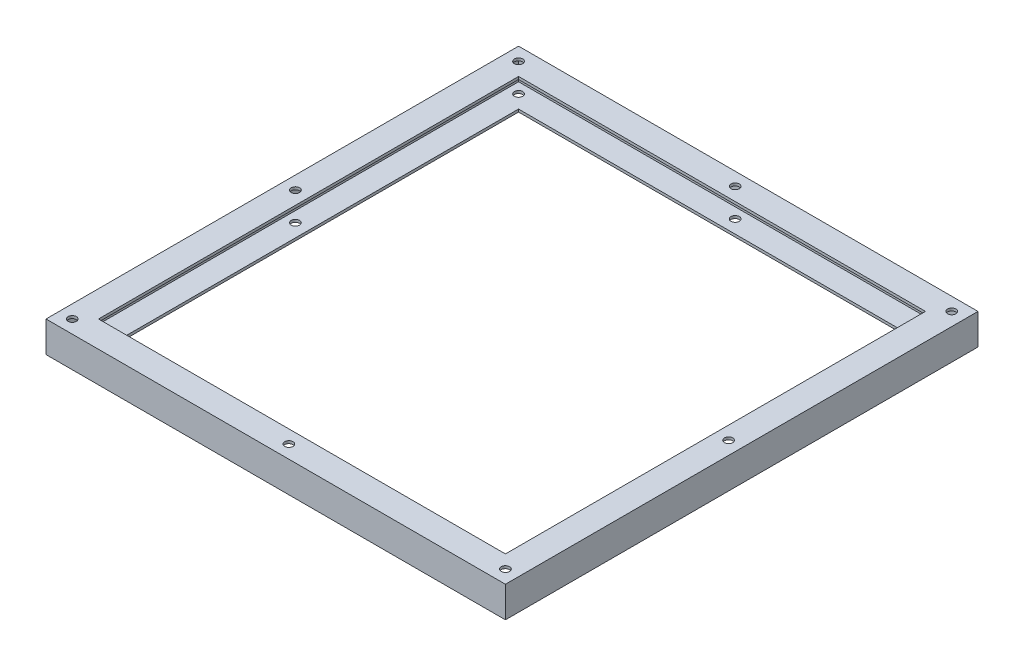
ISO-10303-21;
HEADER;
FILE_DESCRIPTION(('STEP AP214'),'2;1');
FILE_NAME('part.step','',(''),(''),'','','');
FILE_SCHEMA(('AUTOMOTIVE_DESIGN { 1 0 10303 214 1 1 1 1 }'));
ENDSEC;
DATA;
#1=APPLICATION_CONTEXT('core data for automotive mechanical design processes');
#2=APPLICATION_PROTOCOL_DEFINITION('international standard','automotive_design',2000,#1);
#3=PRODUCT_CONTEXT('',#1,'mechanical');
#4=PRODUCT('Part','Part','',(#3));
#5=PRODUCT_RELATED_PRODUCT_CATEGORY('part','',(#4));
#6=PRODUCT_DEFINITION_FORMATION('','',#4);
#7=PRODUCT_DEFINITION_CONTEXT('part definition',#1,'design');
#8=PRODUCT_DEFINITION('design','',#6,#7);
#9=PRODUCT_DEFINITION_SHAPE('','',#8);
#10=(LENGTH_UNIT() NAMED_UNIT(*) SI_UNIT(.MILLI.,.METRE.));
#11=(NAMED_UNIT(*) PLANE_ANGLE_UNIT() SI_UNIT($,.RADIAN.));
#12=(NAMED_UNIT(*) SI_UNIT($,.STERADIAN.) SOLID_ANGLE_UNIT());
#13=UNCERTAINTY_MEASURE_WITH_UNIT(LENGTH_MEASURE(1.E-05),#10,'distance_accuracy_value','');
#14=(GEOMETRIC_REPRESENTATION_CONTEXT(3) GLOBAL_UNCERTAINTY_ASSIGNED_CONTEXT((#13)) GLOBAL_UNIT_ASSIGNED_CONTEXT((#10,
#11,#12)) REPRESENTATION_CONTEXT('',''));
#15=CARTESIAN_POINT('',(0.,0.,0.));
#16=DIRECTION('',(0.,0.,1.));
#17=DIRECTION('',(1.,0.,0.));
#18=AXIS2_PLACEMENT_3D('',#15,#16,#17);
#19=CARTESIAN_POINT('',(0.,23.5,-20.));
#20=DIRECTION('',(0.,0.,1.));
#21=DIRECTION('',(1.,0.,0.));
#22=AXIS2_PLACEMENT_3D('',#19,#20,#21);
#23=PLANE('',#22);
#24=DIRECTION('',(1.,0.,0.));
#25=VECTOR('',#24,1.);
#26=CARTESIAN_POINT('',(0.,21.5,-20.));
#27=LINE('',#26,#25);
#28=CARTESIAN_POINT('',(20.,21.5,-20.));
#29=VERTEX_POINT('',#28);
#30=CARTESIAN_POINT('',(330.,21.5,-20.));
#31=VERTEX_POINT('',#30);
#32=EDGE_CURVE('E60',#29,#31,#27,.T.);
#33=ORIENTED_EDGE('',*,*,#32,.F.);
#34=DIRECTION('',(0.,-1.,0.));
#35=VECTOR('',#34,1.);
#36=CARTESIAN_POINT('',(20.,23.5,-20.));
#37=LINE('',#36,#35);
#38=CARTESIAN_POINT('',(20.,23.5,-20.));
#39=VERTEX_POINT('',#38);
#40=EDGE_CURVE('E344',#39,#29,#37,.T.);
#41=ORIENTED_EDGE('',*,*,#40,.F.);
#42=DIRECTION('',(-1.,0.,0.));
#43=VECTOR('',#42,1.);
#44=CARTESIAN_POINT('',(0.,23.5,-20.));
#45=LINE('',#44,#43);
#46=CARTESIAN_POINT('',(330.,23.5,-20.));
#47=VERTEX_POINT('',#46);
#48=EDGE_CURVE('E278',#47,#39,#45,.T.);
#49=ORIENTED_EDGE('',*,*,#48,.F.);
#50=DIRECTION('',(0.,-1.,0.));
#51=VECTOR('',#50,1.);
#52=CARTESIAN_POINT('',(330.,23.5,-20.));
#53=LINE('',#52,#51);
#54=EDGE_CURVE('E349',#47,#31,#53,.T.);
#55=ORIENTED_EDGE('',*,*,#54,.T.);
#56=EDGE_LOOP('',(#33,#41,#49,#55));
#57=FACE_BOUND('',#56,.T.);
#58=ADVANCED_FACE('F35',(#57),#23,.F.);
#59=CARTESIAN_POINT('',(20.,23.5,0.));
#60=DIRECTION('',(-1.,0.,0.));
#61=DIRECTION('',(0.,0.,1.));
#62=AXIS2_PLACEMENT_3D('',#59,#60,#61);
#63=PLANE('',#62);
#64=DIRECTION('',(0.,0.,1.));
#65=VECTOR('',#64,1.);
#66=CARTESIAN_POINT('',(20.,21.5,0.));
#67=LINE('',#66,#65);
#68=CARTESIAN_POINT('',(20.,21.5,-340.000000000001));
#69=VERTEX_POINT('',#68);
#70=EDGE_CURVE('E249',#69,#29,#67,.T.);
#71=ORIENTED_EDGE('',*,*,#70,.F.);
#72=DIRECTION('',(0.,-1.,0.));
#73=VECTOR('',#72,1.);
#74=CARTESIAN_POINT('',(20.,23.5,-340.000000000001));
#75=LINE('',#74,#73);
#76=CARTESIAN_POINT('',(20.,23.5,-340.000000000001));
#77=VERTEX_POINT('',#76);
#78=EDGE_CURVE('E357',#77,#69,#75,.T.);
#79=ORIENTED_EDGE('',*,*,#78,.F.);
#80=DIRECTION('',(0.,0.,-1.));
#81=VECTOR('',#80,1.);
#82=CARTESIAN_POINT('',(20.,23.5,0.));
#83=LINE('',#82,#81);
#84=EDGE_CURVE('E281',#39,#77,#83,.T.);
#85=ORIENTED_EDGE('',*,*,#84,.F.);
#86=ORIENTED_EDGE('',*,*,#40,.T.);
#87=EDGE_LOOP('',(#71,#79,#85,#86));
#88=FACE_BOUND('',#87,.T.);
#89=ADVANCED_FACE('F427',(#88),#63,.F.);
#90=CARTESIAN_POINT('',(0.,23.5,-340.000000000001));
#91=DIRECTION('',(0.,0.,-1.));
#92=DIRECTION('',(-1.,0.,0.));
#93=AXIS2_PLACEMENT_3D('',#90,#91,#92);
#94=PLANE('',#93);
#95=DIRECTION('',(-1.,0.,0.));
#96=VECTOR('',#95,1.);
#97=CARTESIAN_POINT('',(0.,21.5,-340.000000000001));
#98=LINE('',#97,#96);
#99=CARTESIAN_POINT('',(330.,21.5,-340.000000000001));
#100=VERTEX_POINT('',#99);
#101=EDGE_CURVE('E247',#100,#69,#98,.T.);
#102=ORIENTED_EDGE('',*,*,#101,.F.);
#103=DIRECTION('',(0.,-1.,0.));
#104=VECTOR('',#103,1.);
#105=CARTESIAN_POINT('',(330.,23.5,-340.000000000001));
#106=LINE('',#105,#104);
#107=CARTESIAN_POINT('',(330.,23.5,-340.000000000001));
#108=VERTEX_POINT('',#107);
#109=EDGE_CURVE('E353',#108,#100,#106,.T.);
#110=ORIENTED_EDGE('',*,*,#109,.F.);
#111=DIRECTION('',(1.,0.,0.));
#112=VECTOR('',#111,1.);
#113=CARTESIAN_POINT('',(0.,23.5,-340.000000000001));
#114=LINE('',#113,#112);
#115=EDGE_CURVE('E283',#77,#108,#114,.T.);
#116=ORIENTED_EDGE('',*,*,#115,.F.);
#117=ORIENTED_EDGE('',*,*,#78,.T.);
#118=EDGE_LOOP('',(#102,#110,#116,#117));
#119=FACE_BOUND('',#118,.T.);
#120=ADVANCED_FACE('F434',(#119),#94,.F.);
#121=CARTESIAN_POINT('',(330.,23.5,0.));
#122=DIRECTION('',(1.,0.,0.));
#123=DIRECTION('',(0.,0.,-1.));
#124=AXIS2_PLACEMENT_3D('',#121,#122,#123);
#125=PLANE('',#124);
#126=DIRECTION('',(0.,0.,-1.));
#127=VECTOR('',#126,1.);
#128=CARTESIAN_POINT('',(330.,21.5,0.));
#129=LINE('',#128,#127);
#130=EDGE_CURVE('E245',#31,#100,#129,.T.);
#131=ORIENTED_EDGE('',*,*,#130,.F.);
#132=ORIENTED_EDGE('',*,*,#54,.F.);
#133=DIRECTION('',(0.,0.,1.));
#134=VECTOR('',#133,1.);
#135=CARTESIAN_POINT('',(330.,23.5,0.));
#136=LINE('',#135,#134);
#137=EDGE_CURVE('E285',#108,#47,#136,.T.);
#138=ORIENTED_EDGE('',*,*,#137,.F.);
#139=ORIENTED_EDGE('',*,*,#109,.T.);
#140=EDGE_LOOP('',(#131,#132,#138,#139));
#141=FACE_BOUND('',#140,.T.);
#142=ADVANCED_FACE('F590',(#141),#125,.F.);
#143=CARTESIAN_POINT('',(9.99999999999871,23.5,-9.99999999999871));
#144=DIRECTION('',(0.,-1.,0.));
#145=DIRECTION('',(0.,0.,-1.));
#146=AXIS2_PLACEMENT_3D('',#143,#144,#145);
#147=CYLINDRICAL_SURFACE('',#146,3.175);
#148=CARTESIAN_POINT('',(9.99999999999871,23.5,-9.99999999999871));
#149=DIRECTION('',(0.,1.,0.));
#150=DIRECTION('',(0.,0.,1.));
#151=AXIS2_PLACEMENT_3D('',#148,#149,#150);
#152=CIRCLE('',#151,3.175);
#153=CARTESIAN_POINT('',(9.99999999999871,23.5,-6.82499999999871));
#154=VERTEX_POINT('',#153);
#155=EDGE_CURVE('E275',#154,#154,#152,.T.);
#156=ORIENTED_EDGE('',*,*,#155,.T.);
#157=EDGE_LOOP('',(#156));
#158=FACE_BOUND('',#157,.T.);
#159=CARTESIAN_POINT('',(9.99999999999871,21.5,-9.99999999999871));
#160=DIRECTION('',(0.,-1.,0.));
#161=DIRECTION('',(0.,0.,-1.));
#162=AXIS2_PLACEMENT_3D('',#159,#160,#161);
#163=CIRCLE('',#162,3.175);
#164=CARTESIAN_POINT('',(9.99999999999871,21.5,-13.1749999999987));
#165=VERTEX_POINT('',#164);
#166=EDGE_CURVE('E242',#165,#165,#163,.T.);
#167=ORIENTED_EDGE('',*,*,#166,.T.);
#168=EDGE_LOOP('',(#167));
#169=FACE_BOUND('',#168,.T.);
#170=ADVANCED_FACE('F581',(#158,#169),#147,.F.);
#171=CARTESIAN_POINT('',(175.,23.5,-9.99999999999871));
#172=DIRECTION('',(0.,-1.,0.));
#173=DIRECTION('',(0.,0.,-1.));
#174=AXIS2_PLACEMENT_3D('',#171,#172,#173);
#175=CYLINDRICAL_SURFACE('',#174,3.175);
#176=CARTESIAN_POINT('',(175.,23.5,-9.99999999999871));
#177=DIRECTION('',(0.,1.,0.));
#178=DIRECTION('',(0.,0.,1.));
#179=AXIS2_PLACEMENT_3D('',#176,#177,#178);
#180=CIRCLE('',#179,3.175);
#181=CARTESIAN_POINT('',(175.,23.5,-6.82499999999871));
#182=VERTEX_POINT('',#181);
#183=EDGE_CURVE('E272',#182,#182,#180,.T.);
#184=ORIENTED_EDGE('',*,*,#183,.T.);
#185=EDGE_LOOP('',(#184));
#186=FACE_BOUND('',#185,.T.);
#187=CARTESIAN_POINT('',(175.,21.5,-9.99999999999871));
#188=DIRECTION('',(0.,-1.,0.));
#189=DIRECTION('',(0.,0.,-1.));
#190=AXIS2_PLACEMENT_3D('',#187,#188,#189);
#191=CIRCLE('',#190,3.175);
#192=CARTESIAN_POINT('',(175.,21.5,-13.1749999999987));
#193=VERTEX_POINT('',#192);
#194=EDGE_CURVE('E239',#193,#193,#191,.T.);
#195=ORIENTED_EDGE('',*,*,#194,.T.);
#196=EDGE_LOOP('',(#195));
#197=FACE_BOUND('',#196,.T.);
#198=ADVANCED_FACE('F572',(#186,#197),#175,.F.);
#199=CARTESIAN_POINT('',(340.000000000001,23.5,-10.));
#200=DIRECTION('',(0.,-1.,0.));
#201=DIRECTION('',(0.,0.,-1.));
#202=AXIS2_PLACEMENT_3D('',#199,#200,#201);
#203=CYLINDRICAL_SURFACE('',#202,3.17499999999997);
#204=CARTESIAN_POINT('',(340.000000000001,23.5,-10.));
#205=DIRECTION('',(0.,1.,0.));
#206=DIRECTION('',(0.,0.,1.));
#207=AXIS2_PLACEMENT_3D('',#204,#205,#206);
#208=CIRCLE('',#207,3.17499999999997);
#209=CARTESIAN_POINT('',(340.000000000001,23.5,-6.82500000000008));
#210=VERTEX_POINT('',#209);
#211=EDGE_CURVE('E269',#210,#210,#208,.T.);
#212=ORIENTED_EDGE('',*,*,#211,.T.);
#213=EDGE_LOOP('',(#212));
#214=FACE_BOUND('',#213,.T.);
#215=CARTESIAN_POINT('',(340.000000000001,21.5,-10.));
#216=DIRECTION('',(0.,-1.,0.));
#217=DIRECTION('',(0.,0.,-1.));
#218=AXIS2_PLACEMENT_3D('',#215,#216,#217);
#219=CIRCLE('',#218,3.17499999999997);
#220=CARTESIAN_POINT('',(340.000000000001,21.5,-13.175));
#221=VERTEX_POINT('',#220);
#222=EDGE_CURVE('E236',#221,#221,#219,.T.);
#223=ORIENTED_EDGE('',*,*,#222,.T.);
#224=EDGE_LOOP('',(#223));
#225=FACE_BOUND('',#224,.T.);
#226=ADVANCED_FACE('F561',(#214,#225),#203,.F.);
#227=CARTESIAN_POINT('',(340.000000000001,23.5,-180.000000000001));
#228=DIRECTION('',(0.,-1.,0.));
#229=DIRECTION('',(0.,0.,-1.));
#230=AXIS2_PLACEMENT_3D('',#227,#228,#229);
#231=CYLINDRICAL_SURFACE('',#230,3.17499999999997);
#232=CARTESIAN_POINT('',(340.000000000001,23.5,-180.000000000001));
#233=DIRECTION('',(0.,1.,0.));
#234=DIRECTION('',(0.,0.,1.));
#235=AXIS2_PLACEMENT_3D('',#232,#233,#234);
#236=CIRCLE('',#235,3.17499999999997);
#237=CARTESIAN_POINT('',(340.000000000001,23.5,-176.825000000001));
#238=VERTEX_POINT('',#237);
#239=EDGE_CURVE('E266',#238,#238,#236,.T.);
#240=ORIENTED_EDGE('',*,*,#239,.T.);
#241=EDGE_LOOP('',(#240));
#242=FACE_BOUND('',#241,.T.);
#243=CARTESIAN_POINT('',(340.000000000001,21.5,-180.000000000001));
#244=DIRECTION('',(0.,-1.,0.));
#245=DIRECTION('',(0.,0.,-1.));
#246=AXIS2_PLACEMENT_3D('',#243,#244,#245);
#247=CIRCLE('',#246,3.17499999999997);
#248=CARTESIAN_POINT('',(340.000000000001,21.5,-183.175000000001));
#249=VERTEX_POINT('',#248);
#250=EDGE_CURVE('E233',#249,#249,#247,.T.);
#251=ORIENTED_EDGE('',*,*,#250,.T.);
#252=EDGE_LOOP('',(#251));
#253=FACE_BOUND('',#252,.T.);
#254=ADVANCED_FACE('F550',(#242,#253),#231,.F.);
#255=CARTESIAN_POINT('',(9.99999999999871,23.5,-180.));
#256=DIRECTION('',(0.,-1.,0.));
#257=DIRECTION('',(0.,0.,-1.));
#258=AXIS2_PLACEMENT_3D('',#255,#256,#257);
#259=CYLINDRICAL_SURFACE('',#258,3.175);
#260=CARTESIAN_POINT('',(9.99999999999871,23.5,-180.));
#261=DIRECTION('',(0.,1.,0.));
#262=DIRECTION('',(0.,0.,1.));
#263=AXIS2_PLACEMENT_3D('',#260,#261,#262);
#264=CIRCLE('',#263,3.175);
#265=CARTESIAN_POINT('',(9.99999999999871,23.5,-176.825));
#266=VERTEX_POINT('',#265);
#267=EDGE_CURVE('E263',#266,#266,#264,.T.);
#268=ORIENTED_EDGE('',*,*,#267,.T.);
#269=EDGE_LOOP('',(#268));
#270=FACE_BOUND('',#269,.T.);
#271=CARTESIAN_POINT('',(9.99999999999871,21.5,-180.));
#272=DIRECTION('',(0.,-1.,0.));
#273=DIRECTION('',(0.,0.,-1.));
#274=AXIS2_PLACEMENT_3D('',#271,#272,#273);
#275=CIRCLE('',#274,3.175);
#276=CARTESIAN_POINT('',(9.99999999999871,21.5,-183.175));
#277=VERTEX_POINT('',#276);
#278=EDGE_CURVE('E230',#277,#277,#275,.T.);
#279=ORIENTED_EDGE('',*,*,#278,.T.);
#280=EDGE_LOOP('',(#279));
#281=FACE_BOUND('',#280,.T.);
#282=ADVANCED_FACE('F539',(#270,#281),#259,.F.);
#283=CARTESIAN_POINT('',(340.000000000001,23.5,-350.000000000003));
#284=DIRECTION('',(0.,-1.,0.));
#285=DIRECTION('',(0.,0.,-1.));
#286=AXIS2_PLACEMENT_3D('',#283,#284,#285);
#287=CYLINDRICAL_SURFACE('',#286,3.17499999999997);
#288=CARTESIAN_POINT('',(340.000000000001,23.5,-350.000000000003));
#289=DIRECTION('',(0.,1.,0.));
#290=DIRECTION('',(0.,0.,1.));
#291=AXIS2_PLACEMENT_3D('',#288,#289,#290);
#292=CIRCLE('',#291,3.17499999999997);
#293=CARTESIAN_POINT('',(340.000000000001,23.5,-346.825000000003));
#294=VERTEX_POINT('',#293);
#295=EDGE_CURVE('E260',#294,#294,#292,.T.);
#296=ORIENTED_EDGE('',*,*,#295,.T.);
#297=EDGE_LOOP('',(#296));
#298=FACE_BOUND('',#297,.T.);
#299=CARTESIAN_POINT('',(340.000000000001,21.5,-350.000000000003));
#300=DIRECTION('',(0.,-1.,0.));
#301=DIRECTION('',(0.,0.,-1.));
#302=AXIS2_PLACEMENT_3D('',#299,#300,#301);
#303=CIRCLE('',#302,3.17499999999997);
#304=CARTESIAN_POINT('',(340.000000000001,21.5,-353.175000000003));
#305=VERTEX_POINT('',#304);
#306=EDGE_CURVE('E227',#305,#305,#303,.T.);
#307=ORIENTED_EDGE('',*,*,#306,.T.);
#308=EDGE_LOOP('',(#307));
#309=FACE_BOUND('',#308,.T.);
#310=ADVANCED_FACE('F528',(#298,#309),#287,.F.);
#311=CARTESIAN_POINT('',(175.,23.5,-350.000000000001));
#312=DIRECTION('',(0.,-1.,0.));
#313=DIRECTION('',(0.,0.,-1.));
#314=AXIS2_PLACEMENT_3D('',#311,#312,#313);
#315=CYLINDRICAL_SURFACE('',#314,3.17499999999997);
#316=CARTESIAN_POINT('',(175.,23.5,-350.000000000001));
#317=DIRECTION('',(0.,1.,0.));
#318=DIRECTION('',(0.,0.,1.));
#319=AXIS2_PLACEMENT_3D('',#316,#317,#318);
#320=CIRCLE('',#319,3.17499999999997);
#321=CARTESIAN_POINT('',(175.,23.5,-346.825000000001));
#322=VERTEX_POINT('',#321);
#323=EDGE_CURVE('E256',#322,#322,#320,.T.);
#324=ORIENTED_EDGE('',*,*,#323,.T.);
#325=EDGE_LOOP('',(#324));
#326=FACE_BOUND('',#325,.T.);
#327=CARTESIAN_POINT('',(175.,21.5,-350.000000000001));
#328=DIRECTION('',(0.,-1.,0.));
#329=DIRECTION('',(0.,0.,-1.));
#330=AXIS2_PLACEMENT_3D('',#327,#328,#329);
#331=CIRCLE('',#330,3.17499999999997);
#332=CARTESIAN_POINT('',(175.,21.5,-353.175000000001));
#333=VERTEX_POINT('',#332);
#334=EDGE_CURVE('E224',#333,#333,#331,.T.);
#335=ORIENTED_EDGE('',*,*,#334,.T.);
#336=EDGE_LOOP('',(#335));
#337=FACE_BOUND('',#336,.T.);
#338=ADVANCED_FACE('F517',(#326,#337),#315,.F.);
#339=CARTESIAN_POINT('',(9.99999999999872,23.5,-350.000000000001));
#340=DIRECTION('',(0.,-1.,0.));
#341=DIRECTION('',(0.,0.,-1.));
#342=AXIS2_PLACEMENT_3D('',#339,#340,#341);
#343=CYLINDRICAL_SURFACE('',#342,3.175);
#344=CARTESIAN_POINT('',(9.99999999999872,23.5,-350.000000000001));
#345=DIRECTION('',(0.,1.,0.));
#346=DIRECTION('',(0.,0.,1.));
#347=AXIS2_PLACEMENT_3D('',#344,#345,#346);
#348=CIRCLE('',#347,3.175);
#349=CARTESIAN_POINT('',(9.99999999999872,23.5,-346.825000000001));
#350=VERTEX_POINT('',#349);
#351=EDGE_CURVE('E253',#350,#350,#348,.T.);
#352=ORIENTED_EDGE('',*,*,#351,.T.);
#353=EDGE_LOOP('',(#352));
#354=FACE_BOUND('',#353,.T.);
#355=CARTESIAN_POINT('',(9.99999999999872,21.5,-350.000000000001));
#356=DIRECTION('',(0.,-1.,0.));
#357=DIRECTION('',(0.,0.,-1.));
#358=AXIS2_PLACEMENT_3D('',#355,#356,#357);
#359=CIRCLE('',#358,3.175);
#360=CARTESIAN_POINT('',(9.99999999999872,21.5,-353.175000000001));
#361=VERTEX_POINT('',#360);
#362=EDGE_CURVE('E39',#361,#361,#359,.T.);
#363=ORIENTED_EDGE('',*,*,#362,.T.);
#364=EDGE_LOOP('',(#363));
#365=FACE_BOUND('',#364,.T.);
#366=ADVANCED_FACE('F372',(#354,#365),#343,.F.);
#367=CARTESIAN_POINT('',(-1.37033241896591E-12,23.5,-360.));
#368=DIRECTION('',(0.,0.,1.));
#369=DIRECTION('',(1.,0.,0.));
#370=AXIS2_PLACEMENT_3D('',#367,#368,#369);
#371=PLANE('',#370);
#372=DIRECTION('',(-1.,0.,0.));
#373=VECTOR('',#372,1.);
#374=CARTESIAN_POINT('',(-1.37033241896591E-12,0.,-360.));
#375=LINE('',#374,#373);
#376=CARTESIAN_POINT('',(350.,0.,-360.000000000001));
#377=VERTEX_POINT('',#376);
#378=CARTESIAN_POINT('',(0.,0.,-360.));
#379=VERTEX_POINT('',#378);
#380=EDGE_CURVE('E332',#377,#379,#375,.T.);
#381=ORIENTED_EDGE('',*,*,#380,.T.);
#382=DIRECTION('',(0.,-1.,0.));
#383=VECTOR('',#382,1.);
#384=CARTESIAN_POINT('',(0.,23.5,-360.));
#385=LINE('',#384,#383);
#386=CARTESIAN_POINT('',(0.,23.5,-360.));
#387=VERTEX_POINT('',#386);
#388=EDGE_CURVE('E11',#387,#379,#385,.T.);
#389=ORIENTED_EDGE('',*,*,#388,.F.);
#390=DIRECTION('',(-1.,0.,0.));
#391=VECTOR('',#390,1.);
#392=CARTESIAN_POINT('',(-1.37033241896591E-12,23.5,-360.));
#393=LINE('',#392,#391);
#394=CARTESIAN_POINT('',(350.,23.5,-360.000000000001));
#395=VERTEX_POINT('',#394);
#396=EDGE_CURVE('E287',#395,#387,#393,.T.);
#397=ORIENTED_EDGE('',*,*,#396,.F.);
#398=DIRECTION('',(0.,-1.,0.));
#399=VECTOR('',#398,1.);
#400=CARTESIAN_POINT('',(350.,23.5,-360.000000000001));
#401=LINE('',#400,#399);
#402=EDGE_CURVE('E340',#395,#377,#401,.T.);
#403=ORIENTED_EDGE('',*,*,#402,.T.);
#404=EDGE_LOOP('',(#381,#389,#397,#403));
#405=FACE_BOUND('',#404,.T.);
#406=ADVANCED_FACE('F403',(#405),#371,.F.);
#407=CARTESIAN_POINT('',(0.,23.5,0.));
#408=DIRECTION('',(1.,0.,0.));
#409=DIRECTION('',(0.,0.,-1.));
#410=AXIS2_PLACEMENT_3D('',#407,#408,#409);
#411=PLANE('',#410);
#412=DIRECTION('',(0.,0.,1.));
#413=VECTOR('',#412,1.);
#414=CARTESIAN_POINT('',(0.,0.,0.));
#415=LINE('',#414,#413);
#416=CARTESIAN_POINT('',(0.,0.,0.));
#417=VERTEX_POINT('',#416);
#418=EDGE_CURVE('E335',#379,#417,#415,.T.);
#419=ORIENTED_EDGE('',*,*,#418,.T.);
#420=DIRECTION('',(0.,-1.,0.));
#421=VECTOR('',#420,1.);
#422=CARTESIAN_POINT('',(0.,23.5,0.));
#423=LINE('',#422,#421);
#424=CARTESIAN_POINT('',(0.,23.5,0.));
#425=VERTEX_POINT('',#424);
#426=EDGE_CURVE('E44',#425,#417,#423,.T.);
#427=ORIENTED_EDGE('',*,*,#426,.F.);
#428=DIRECTION('',(0.,0.,1.));
#429=VECTOR('',#428,1.);
#430=CARTESIAN_POINT('',(0.,23.5,0.));
#431=LINE('',#430,#429);
#432=EDGE_CURVE('E290',#387,#425,#431,.T.);
#433=ORIENTED_EDGE('',*,*,#432,.F.);
#434=ORIENTED_EDGE('',*,*,#388,.T.);
#435=EDGE_LOOP('',(#419,#427,#433,#434));
#436=FACE_BOUND('',#435,.T.);
#437=ADVANCED_FACE('F414',(#436),#411,.F.);
#438=CARTESIAN_POINT('',(0.,23.5,0.));
#439=DIRECTION('',(0.,0.,-1.));
#440=DIRECTION('',(-1.,0.,0.));
#441=AXIS2_PLACEMENT_3D('',#438,#439,#440);
#442=PLANE('',#441);
#443=DIRECTION('',(1.,0.,0.));
#444=VECTOR('',#443,1.);
#445=CARTESIAN_POINT('',(0.,0.,0.));
#446=LINE('',#445,#444);
#447=CARTESIAN_POINT('',(350.,0.,0.));
#448=VERTEX_POINT('',#447);
#449=EDGE_CURVE('E337',#417,#448,#446,.T.);
#450=ORIENTED_EDGE('',*,*,#449,.T.);
#451=DIRECTION('',(0.,-1.,0.));
#452=VECTOR('',#451,1.);
#453=CARTESIAN_POINT('',(350.,23.5,0.));
#454=LINE('',#453,#452);
#455=CARTESIAN_POINT('',(350.,23.5,0.));
#456=VERTEX_POINT('',#455);
#457=EDGE_CURVE('E343',#456,#448,#454,.T.);
#458=ORIENTED_EDGE('',*,*,#457,.F.);
#459=DIRECTION('',(1.,0.,0.));
#460=VECTOR('',#459,1.);
#461=CARTESIAN_POINT('',(0.,23.5,0.));
#462=LINE('',#461,#460);
#463=EDGE_CURVE('E292',#425,#456,#462,.T.);
#464=ORIENTED_EDGE('',*,*,#463,.F.);
#465=ORIENTED_EDGE('',*,*,#426,.T.);
#466=EDGE_LOOP('',(#450,#458,#464,#465));
#467=FACE_BOUND('',#466,.T.);
#468=ADVANCED_FACE('F411',(#467),#442,.F.);
#469=CARTESIAN_POINT('',(20.,2.,-20.));
#470=VERTEX_POINT('',#469);
#471=CARTESIAN_POINT('',(20.,0.,-20.));
#472=VERTEX_POINT('',#471);
#473=EDGE_CURVE('E360',#470,#472,#37,.T.);
#474=ORIENTED_EDGE('',*,*,#473,.F.);
#475=DIRECTION('',(1.,0.,0.));
#476=VECTOR('',#475,1.);
#477=CARTESIAN_POINT('',(0.,2.,-20.));
#478=LINE('',#477,#476);
#479=CARTESIAN_POINT('',(330.,2.,-20.));
#480=VERTEX_POINT('',#479);
#481=EDGE_CURVE('E221',#470,#480,#478,.T.);
#482=ORIENTED_EDGE('',*,*,#481,.T.);
#483=CARTESIAN_POINT('',(330.,0.,-20.));
#484=VERTEX_POINT('',#483);
#485=EDGE_CURVE('E296',#480,#484,#53,.T.);
#486=ORIENTED_EDGE('',*,*,#485,.T.);
#487=DIRECTION('',(-1.,0.,0.));
#488=VECTOR('',#487,1.);
#489=CARTESIAN_POINT('',(0.,0.,-20.));
#490=LINE('',#489,#488);
#491=EDGE_CURVE('E320',#484,#472,#490,.T.);
#492=ORIENTED_EDGE('',*,*,#491,.T.);
#493=EDGE_LOOP('',(#474,#482,#486,#492));
#494=FACE_BOUND('',#493,.T.);
#495=ADVANCED_FACE('F430',(#494),#23,.F.);
#496=CARTESIAN_POINT('',(20.,2.,-340.000000000001));
#497=VERTEX_POINT('',#496);
#498=CARTESIAN_POINT('',(20.,0.,-340.000000000001));
#499=VERTEX_POINT('',#498);
#500=EDGE_CURVE('E356',#497,#499,#75,.T.);
#501=ORIENTED_EDGE('',*,*,#500,.F.);
#502=DIRECTION('',(0.,0.,1.));
#503=VECTOR('',#502,1.);
#504=CARTESIAN_POINT('',(20.,2.,0.));
#505=LINE('',#504,#503);
#506=EDGE_CURVE('E218',#497,#470,#505,.T.);
#507=ORIENTED_EDGE('',*,*,#506,.T.);
#508=ORIENTED_EDGE('',*,*,#473,.T.);
#509=DIRECTION('',(0.,0.,-1.));
#510=VECTOR('',#509,1.);
#511=CARTESIAN_POINT('',(20.,0.,0.));
#512=LINE('',#511,#510);
#513=EDGE_CURVE('E323',#472,#499,#512,.T.);
#514=ORIENTED_EDGE('',*,*,#513,.T.);
#515=EDGE_LOOP('',(#501,#507,#508,#514));
#516=FACE_BOUND('',#515,.T.);
#517=ADVANCED_FACE('F437',(#516),#63,.F.);
#518=CARTESIAN_POINT('',(330.,2.,-340.000000000001));
#519=VERTEX_POINT('',#518);
#520=CARTESIAN_POINT('',(330.,0.,-340.000000000001));
#521=VERTEX_POINT('',#520);
#522=EDGE_CURVE('E352',#519,#521,#106,.T.);
#523=ORIENTED_EDGE('',*,*,#522,.F.);
#524=DIRECTION('',(-1.,0.,0.));
#525=VECTOR('',#524,1.);
#526=CARTESIAN_POINT('',(0.,2.,-340.000000000001));
#527=LINE('',#526,#525);
#528=EDGE_CURVE('E52',#519,#497,#527,.T.);
#529=ORIENTED_EDGE('',*,*,#528,.T.);
#530=ORIENTED_EDGE('',*,*,#500,.T.);
#531=DIRECTION('',(1.,0.,0.));
#532=VECTOR('',#531,1.);
#533=CARTESIAN_POINT('',(0.,0.,-340.000000000001));
#534=LINE('',#533,#532);
#535=EDGE_CURVE('E326',#499,#521,#534,.T.);
#536=ORIENTED_EDGE('',*,*,#535,.T.);
#537=EDGE_LOOP('',(#523,#529,#530,#536));
#538=FACE_BOUND('',#537,.T.);
#539=ADVANCED_FACE('F445',(#538),#94,.F.);
#540=ORIENTED_EDGE('',*,*,#485,.F.);
#541=DIRECTION('',(0.,0.,-1.));
#542=VECTOR('',#541,1.);
#543=CARTESIAN_POINT('',(330.,2.,0.));
#544=LINE('',#543,#542);
#545=EDGE_CURVE('E215',#480,#519,#544,.T.);
#546=ORIENTED_EDGE('',*,*,#545,.T.);
#547=ORIENTED_EDGE('',*,*,#522,.T.);
#548=DIRECTION('',(0.,0.,1.));
#549=VECTOR('',#548,1.);
#550=CARTESIAN_POINT('',(330.,0.,0.));
#551=LINE('',#550,#549);
#552=EDGE_CURVE('E329',#521,#484,#551,.T.);
#553=ORIENTED_EDGE('',*,*,#552,.T.);
#554=EDGE_LOOP('',(#540,#546,#547,#553));
#555=FACE_BOUND('',#554,.T.);
#556=ADVANCED_FACE('F455',(#555),#125,.F.);
#557=CARTESIAN_POINT('',(9.99999999999871,2.,-9.99999999999871));
#558=DIRECTION('',(0.,-1.,0.));
#559=DIRECTION('',(0.,0.,-1.));
#560=AXIS2_PLACEMENT_3D('',#557,#558,#559);
#561=CIRCLE('',#560,3.175);
#562=CARTESIAN_POINT('',(9.99999999999871,2.,-13.1749999999987));
#563=VERTEX_POINT('',#562);
#564=EDGE_CURVE('E212',#563,#563,#561,.T.);
#565=ORIENTED_EDGE('',*,*,#564,.F.);
#566=EDGE_LOOP('',(#565));
#567=FACE_BOUND('',#566,.T.);
#568=CARTESIAN_POINT('',(9.99999999999871,0.,-9.99999999999871));
#569=DIRECTION('',(0.,1.,0.));
#570=DIRECTION('',(0.,0.,1.));
#571=AXIS2_PLACEMENT_3D('',#568,#569,#570);
#572=CIRCLE('',#571,3.175);
#573=CARTESIAN_POINT('',(9.99999999999871,0.,-6.82499999999871));
#574=VERTEX_POINT('',#573);
#575=EDGE_CURVE('E317',#574,#574,#572,.T.);
#576=ORIENTED_EDGE('',*,*,#575,.F.);
#577=EDGE_LOOP('',(#576));
#578=FACE_BOUND('',#577,.T.);
#579=ADVANCED_FACE('F569',(#567,#578),#147,.F.);
#580=CARTESIAN_POINT('',(175.,2.,-9.99999999999871));
#581=DIRECTION('',(0.,-1.,0.));
#582=DIRECTION('',(0.,0.,-1.));
#583=AXIS2_PLACEMENT_3D('',#580,#581,#582);
#584=CIRCLE('',#583,3.175);
#585=CARTESIAN_POINT('',(175.,2.,-13.1749999999987));
#586=VERTEX_POINT('',#585);
#587=EDGE_CURVE('E209',#586,#586,#584,.T.);
#588=ORIENTED_EDGE('',*,*,#587,.F.);
#589=EDGE_LOOP('',(#588));
#590=FACE_BOUND('',#589,.T.);
#591=CARTESIAN_POINT('',(175.,0.,-9.99999999999871));
#592=DIRECTION('',(0.,1.,0.));
#593=DIRECTION('',(0.,0.,1.));
#594=AXIS2_PLACEMENT_3D('',#591,#592,#593);
#595=CIRCLE('',#594,3.175);
#596=CARTESIAN_POINT('',(175.,0.,-6.82499999999871));
#597=VERTEX_POINT('',#596);
#598=EDGE_CURVE('E314',#597,#597,#595,.T.);
#599=ORIENTED_EDGE('',*,*,#598,.F.);
#600=EDGE_LOOP('',(#599));
#601=FACE_BOUND('',#600,.T.);
#602=ADVANCED_FACE('F558',(#590,#601),#175,.F.);
#603=CARTESIAN_POINT('',(340.000000000001,2.,-10.));
#604=DIRECTION('',(0.,-1.,0.));
#605=DIRECTION('',(0.,0.,-1.));
#606=AXIS2_PLACEMENT_3D('',#603,#604,#605);
#607=CIRCLE('',#606,3.17499999999997);
#608=CARTESIAN_POINT('',(340.000000000001,2.,-13.175));
#609=VERTEX_POINT('',#608);
#610=EDGE_CURVE('E206',#609,#609,#607,.T.);
#611=ORIENTED_EDGE('',*,*,#610,.F.);
#612=EDGE_LOOP('',(#611));
#613=FACE_BOUND('',#612,.T.);
#614=CARTESIAN_POINT('',(340.000000000001,0.,-10.));
#615=DIRECTION('',(0.,1.,0.));
#616=DIRECTION('',(0.,0.,1.));
#617=AXIS2_PLACEMENT_3D('',#614,#615,#616);
#618=CIRCLE('',#617,3.17499999999997);
#619=CARTESIAN_POINT('',(340.000000000001,0.,-6.82500000000008));
#620=VERTEX_POINT('',#619);
#621=EDGE_CURVE('E311',#620,#620,#618,.T.);
#622=ORIENTED_EDGE('',*,*,#621,.F.);
#623=EDGE_LOOP('',(#622));
#624=FACE_BOUND('',#623,.T.);
#625=ADVANCED_FACE('F547',(#613,#624),#203,.F.);
#626=CARTESIAN_POINT('',(340.000000000001,2.,-180.000000000001));
#627=DIRECTION('',(0.,-1.,0.));
#628=DIRECTION('',(0.,0.,-1.));
#629=AXIS2_PLACEMENT_3D('',#626,#627,#628);
#630=CIRCLE('',#629,3.17499999999997);
#631=CARTESIAN_POINT('',(340.000000000001,2.,-183.175000000001));
#632=VERTEX_POINT('',#631);
#633=EDGE_CURVE('E203',#632,#632,#630,.T.);
#634=ORIENTED_EDGE('',*,*,#633,.F.);
#635=EDGE_LOOP('',(#634));
#636=FACE_BOUND('',#635,.T.);
#637=CARTESIAN_POINT('',(340.000000000001,0.,-180.000000000001));
#638=DIRECTION('',(0.,1.,0.));
#639=DIRECTION('',(0.,0.,1.));
#640=AXIS2_PLACEMENT_3D('',#637,#638,#639);
#641=CIRCLE('',#640,3.17499999999997);
#642=CARTESIAN_POINT('',(340.000000000001,0.,-176.825000000001));
#643=VERTEX_POINT('',#642);
#644=EDGE_CURVE('E308',#643,#643,#641,.T.);
#645=ORIENTED_EDGE('',*,*,#644,.F.);
#646=EDGE_LOOP('',(#645));
#647=FACE_BOUND('',#646,.T.);
#648=ADVANCED_FACE('F536',(#636,#647),#231,.F.);
#649=CARTESIAN_POINT('',(9.99999999999871,2.,-180.));
#650=DIRECTION('',(0.,-1.,0.));
#651=DIRECTION('',(0.,0.,-1.));
#652=AXIS2_PLACEMENT_3D('',#649,#650,#651);
#653=CIRCLE('',#652,3.175);
#654=CARTESIAN_POINT('',(9.99999999999871,2.,-183.175));
#655=VERTEX_POINT('',#654);
#656=EDGE_CURVE('E200',#655,#655,#653,.T.);
#657=ORIENTED_EDGE('',*,*,#656,.F.);
#658=EDGE_LOOP('',(#657));
#659=FACE_BOUND('',#658,.T.);
#660=CARTESIAN_POINT('',(9.99999999999871,0.,-180.));
#661=DIRECTION('',(0.,1.,0.));
#662=DIRECTION('',(0.,0.,1.));
#663=AXIS2_PLACEMENT_3D('',#660,#661,#662);
#664=CIRCLE('',#663,3.175);
#665=CARTESIAN_POINT('',(9.99999999999871,0.,-176.825));
#666=VERTEX_POINT('',#665);
#667=EDGE_CURVE('E305',#666,#666,#664,.T.);
#668=ORIENTED_EDGE('',*,*,#667,.F.);
#669=EDGE_LOOP('',(#668));
#670=FACE_BOUND('',#669,.T.);
#671=ADVANCED_FACE('F525',(#659,#670),#259,.F.);
#672=CARTESIAN_POINT('',(340.000000000001,2.,-350.000000000003));
#673=DIRECTION('',(0.,-1.,0.));
#674=DIRECTION('',(0.,0.,-1.));
#675=AXIS2_PLACEMENT_3D('',#672,#673,#674);
#676=CIRCLE('',#675,3.17499999999997);
#677=CARTESIAN_POINT('',(340.000000000001,2.,-353.175000000003));
#678=VERTEX_POINT('',#677);
#679=EDGE_CURVE('E197',#678,#678,#676,.T.);
#680=ORIENTED_EDGE('',*,*,#679,.F.);
#681=EDGE_LOOP('',(#680));
#682=FACE_BOUND('',#681,.T.);
#683=CARTESIAN_POINT('',(340.000000000001,0.,-350.000000000003));
#684=DIRECTION('',(0.,1.,0.));
#685=DIRECTION('',(0.,0.,1.));
#686=AXIS2_PLACEMENT_3D('',#683,#684,#685);
#687=CIRCLE('',#686,3.17499999999997);
#688=CARTESIAN_POINT('',(340.000000000001,0.,-346.825000000003));
#689=VERTEX_POINT('',#688);
#690=EDGE_CURVE('E302',#689,#689,#687,.T.);
#691=ORIENTED_EDGE('',*,*,#690,.F.);
#692=EDGE_LOOP('',(#691));
#693=FACE_BOUND('',#692,.T.);
#694=ADVANCED_FACE('F515',(#682,#693),#287,.F.);
#695=CARTESIAN_POINT('',(175.,2.,-350.000000000001));
#696=DIRECTION('',(0.,-1.,0.));
#697=DIRECTION('',(0.,0.,-1.));
#698=AXIS2_PLACEMENT_3D('',#695,#696,#697);
#699=CIRCLE('',#698,3.17499999999997);
#700=CARTESIAN_POINT('',(175.,2.,-353.175000000001));
#701=VERTEX_POINT('',#700);
#702=EDGE_CURVE('E194',#701,#701,#699,.T.);
#703=ORIENTED_EDGE('',*,*,#702,.F.);
#704=EDGE_LOOP('',(#703));
#705=FACE_BOUND('',#704,.T.);
#706=CARTESIAN_POINT('',(175.,0.,-350.000000000001));
#707=DIRECTION('',(0.,1.,0.));
#708=DIRECTION('',(0.,0.,1.));
#709=AXIS2_PLACEMENT_3D('',#706,#707,#708);
#710=CIRCLE('',#709,3.17499999999997);
#711=CARTESIAN_POINT('',(175.,0.,-346.825000000001));
#712=VERTEX_POINT('',#711);
#713=EDGE_CURVE('E299',#712,#712,#710,.T.);
#714=ORIENTED_EDGE('',*,*,#713,.F.);
#715=EDGE_LOOP('',(#714));
#716=FACE_BOUND('',#715,.T.);
#717=ADVANCED_FACE('F371',(#705,#716),#315,.F.);
#718=CARTESIAN_POINT('',(9.99999999999872,2.,-350.000000000001));
#719=DIRECTION('',(0.,-1.,0.));
#720=DIRECTION('',(0.,0.,-1.));
#721=AXIS2_PLACEMENT_3D('',#718,#719,#720);
#722=CIRCLE('',#721,3.175);
#723=CARTESIAN_POINT('',(9.99999999999872,2.,-353.175000000001));
#724=VERTEX_POINT('',#723);
#725=EDGE_CURVE('E190',#724,#724,#722,.T.);
#726=ORIENTED_EDGE('',*,*,#725,.F.);
#727=EDGE_LOOP('',(#726));
#728=FACE_BOUND('',#727,.T.);
#729=CARTESIAN_POINT('',(9.99999999999872,0.,-350.000000000001));
#730=DIRECTION('',(0.,1.,0.));
#731=DIRECTION('',(0.,0.,1.));
#732=AXIS2_PLACEMENT_3D('',#729,#730,#731);
#733=CIRCLE('',#732,3.175);
#734=CARTESIAN_POINT('',(9.99999999999872,0.,-346.825000000001));
#735=VERTEX_POINT('',#734);
#736=EDGE_CURVE('E252',#735,#735,#733,.T.);
#737=ORIENTED_EDGE('',*,*,#736,.F.);
#738=EDGE_LOOP('',(#737));
#739=FACE_BOUND('',#738,.T.);
#740=ADVANCED_FACE('F37',(#728,#739),#343,.F.);
#741=CARTESIAN_POINT('',(350.,23.5,0.));
#742=DIRECTION('',(-1.,0.,0.));
#743=DIRECTION('',(0.,0.,1.));
#744=AXIS2_PLACEMENT_3D('',#741,#742,#743);
#745=PLANE('',#744);
#746=DIRECTION('',(0.,0.,-1.));
#747=VECTOR('',#746,1.);
#748=CARTESIAN_POINT('',(350.,0.,0.));
#749=LINE('',#748,#747);
#750=EDGE_CURVE('E257',#448,#377,#749,.T.);
#751=ORIENTED_EDGE('',*,*,#750,.T.);
#752=ORIENTED_EDGE('',*,*,#402,.F.);
#753=DIRECTION('',(0.,0.,-1.));
#754=VECTOR('',#753,1.);
#755=CARTESIAN_POINT('',(350.,23.5,0.));
#756=LINE('',#755,#754);
#757=EDGE_CURVE('E294',#456,#395,#756,.T.);
#758=ORIENTED_EDGE('',*,*,#757,.F.);
#759=ORIENTED_EDGE('',*,*,#457,.T.);
#760=EDGE_LOOP('',(#751,#752,#758,#759));
#761=FACE_BOUND('',#760,.T.);
#762=ADVANCED_FACE('F370',(#761),#745,.F.);
#763=CARTESIAN_POINT('',(0.,23.5,0.));
#764=DIRECTION('',(0.,1.,0.));
#765=DIRECTION('',(0.,0.,1.));
#766=AXIS2_PLACEMENT_3D('',#763,#764,#765);
#767=PLANE('',#766);
#768=ORIENTED_EDGE('',*,*,#351,.F.);
#769=EDGE_LOOP('',(#768));
#770=FACE_BOUND('',#769,.T.);
#771=ORIENTED_EDGE('',*,*,#323,.F.);
#772=EDGE_LOOP('',(#771));
#773=FACE_BOUND('',#772,.T.);
#774=ORIENTED_EDGE('',*,*,#295,.F.);
#775=EDGE_LOOP('',(#774));
#776=FACE_BOUND('',#775,.T.);
#777=ORIENTED_EDGE('',*,*,#267,.F.);
#778=EDGE_LOOP('',(#777));
#779=FACE_BOUND('',#778,.T.);
#780=ORIENTED_EDGE('',*,*,#239,.F.);
#781=EDGE_LOOP('',(#780));
#782=FACE_BOUND('',#781,.T.);
#783=ORIENTED_EDGE('',*,*,#211,.F.);
#784=EDGE_LOOP('',(#783));
#785=FACE_BOUND('',#784,.T.);
#786=ORIENTED_EDGE('',*,*,#183,.F.);
#787=EDGE_LOOP('',(#786));
#788=FACE_BOUND('',#787,.T.);
#789=ORIENTED_EDGE('',*,*,#155,.F.);
#790=EDGE_LOOP('',(#789));
#791=FACE_BOUND('',#790,.T.);
#792=ORIENTED_EDGE('',*,*,#48,.T.);
#793=ORIENTED_EDGE('',*,*,#84,.T.);
#794=ORIENTED_EDGE('',*,*,#115,.T.);
#795=ORIENTED_EDGE('',*,*,#137,.T.);
#796=EDGE_LOOP('',(#792,#793,#794,#795));
#797=FACE_BOUND('',#796,.T.);
#798=ORIENTED_EDGE('',*,*,#396,.T.);
#799=ORIENTED_EDGE('',*,*,#432,.T.);
#800=ORIENTED_EDGE('',*,*,#463,.T.);
#801=ORIENTED_EDGE('',*,*,#757,.T.);
#802=EDGE_LOOP('',(#798,#799,#800,#801));
#803=FACE_BOUND('',#802,.T.);
#804=ADVANCED_FACE('F378',(#770,#773,#776,#779,#782,#785,#788,#791,#797,#803),#767,.T.);
#805=CARTESIAN_POINT('',(0.,0.,0.));
#806=DIRECTION('',(0.,1.,0.));
#807=DIRECTION('',(0.,0.,1.));
#808=AXIS2_PLACEMENT_3D('',#805,#806,#807);
#809=PLANE('',#808);
#810=ORIENTED_EDGE('',*,*,#736,.T.);
#811=EDGE_LOOP('',(#810));
#812=FACE_BOUND('',#811,.T.);
#813=ORIENTED_EDGE('',*,*,#713,.T.);
#814=EDGE_LOOP('',(#813));
#815=FACE_BOUND('',#814,.T.);
#816=ORIENTED_EDGE('',*,*,#690,.T.);
#817=EDGE_LOOP('',(#816));
#818=FACE_BOUND('',#817,.T.);
#819=ORIENTED_EDGE('',*,*,#667,.T.);
#820=EDGE_LOOP('',(#819));
#821=FACE_BOUND('',#820,.T.);
#822=ORIENTED_EDGE('',*,*,#644,.T.);
#823=EDGE_LOOP('',(#822));
#824=FACE_BOUND('',#823,.T.);
#825=ORIENTED_EDGE('',*,*,#621,.T.);
#826=EDGE_LOOP('',(#825));
#827=FACE_BOUND('',#826,.T.);
#828=ORIENTED_EDGE('',*,*,#598,.T.);
#829=EDGE_LOOP('',(#828));
#830=FACE_BOUND('',#829,.T.);
#831=ORIENTED_EDGE('',*,*,#575,.T.);
#832=EDGE_LOOP('',(#831));
#833=FACE_BOUND('',#832,.T.);
#834=ORIENTED_EDGE('',*,*,#491,.F.);
#835=ORIENTED_EDGE('',*,*,#552,.F.);
#836=ORIENTED_EDGE('',*,*,#535,.F.);
#837=ORIENTED_EDGE('',*,*,#513,.F.);
#838=EDGE_LOOP('',(#834,#835,#836,#837));
#839=FACE_BOUND('',#838,.T.);
#840=ORIENTED_EDGE('',*,*,#380,.F.);
#841=ORIENTED_EDGE('',*,*,#750,.F.);
#842=ORIENTED_EDGE('',*,*,#449,.F.);
#843=ORIENTED_EDGE('',*,*,#418,.F.);
#844=EDGE_LOOP('',(#840,#841,#842,#843));
#845=FACE_BOUND('',#844,.T.);
#846=ADVANCED_FACE('F375',(#812,#815,#818,#821,#824,#827,#830,#833,#839,#845),#809,.F.);
#847=CARTESIAN_POINT('',(0.,21.5,0.));
#848=DIRECTION('',(0.,-1.,0.));
#849=DIRECTION('',(0.,0.,-1.));
#850=AXIS2_PLACEMENT_3D('',#847,#848,#849);
#851=PLANE('',#850);
#852=DIRECTION('',(-1.,0.,0.));
#853=VECTOR('',#852,1.);
#854=CARTESIAN_POINT('',(348.,21.5,-2.00000000000006));
#855=LINE('',#854,#853);
#856=CARTESIAN_POINT('',(348.,21.5,-2.00000000000006));
#857=VERTEX_POINT('',#856);
#858=CARTESIAN_POINT('',(2.00000000000006,21.5,-2.));
#859=VERTEX_POINT('',#858);
#860=EDGE_CURVE('E154',#857,#859,#855,.T.);
#861=ORIENTED_EDGE('',*,*,#860,.T.);
#862=DIRECTION('',(0.,0.,-1.));
#863=VECTOR('',#862,1.);
#864=CARTESIAN_POINT('',(2.00000000000006,21.5,-2.));
#865=LINE('',#864,#863);
#866=CARTESIAN_POINT('',(2.00000000000007,21.5,-358.));
#867=VERTEX_POINT('',#866);
#868=EDGE_CURVE('E165',#859,#867,#865,.T.);
#869=ORIENTED_EDGE('',*,*,#868,.T.);
#870=DIRECTION('',(1.,0.,0.));
#871=VECTOR('',#870,1.);
#872=CARTESIAN_POINT('',(2.00000000000007,21.5,-358.));
#873=LINE('',#872,#871);
#874=CARTESIAN_POINT('',(348.,21.5,-358.));
#875=VERTEX_POINT('',#874);
#876=EDGE_CURVE('E170',#867,#875,#873,.T.);
#877=ORIENTED_EDGE('',*,*,#876,.T.);
#878=DIRECTION('',(0.,0.,1.));
#879=VECTOR('',#878,1.);
#880=CARTESIAN_POINT('',(348.,21.5,-358.));
#881=LINE('',#880,#879);
#882=EDGE_CURVE('E162',#875,#857,#881,.T.);
#883=ORIENTED_EDGE('',*,*,#882,.T.);
#884=EDGE_LOOP('',(#861,#869,#877,#883));
#885=FACE_BOUND('',#884,.T.);
#886=ORIENTED_EDGE('',*,*,#362,.F.);
#887=EDGE_LOOP('',(#886));
#888=FACE_BOUND('',#887,.T.);
#889=ORIENTED_EDGE('',*,*,#334,.F.);
#890=EDGE_LOOP('',(#889));
#891=FACE_BOUND('',#890,.T.);
#892=ORIENTED_EDGE('',*,*,#306,.F.);
#893=EDGE_LOOP('',(#892));
#894=FACE_BOUND('',#893,.T.);
#895=ORIENTED_EDGE('',*,*,#278,.F.);
#896=EDGE_LOOP('',(#895));
#897=FACE_BOUND('',#896,.T.);
#898=ORIENTED_EDGE('',*,*,#250,.F.);
#899=EDGE_LOOP('',(#898));
#900=FACE_BOUND('',#899,.T.);
#901=ORIENTED_EDGE('',*,*,#222,.F.);
#902=EDGE_LOOP('',(#901));
#903=FACE_BOUND('',#902,.T.);
#904=ORIENTED_EDGE('',*,*,#194,.F.);
#905=EDGE_LOOP('',(#904));
#906=FACE_BOUND('',#905,.T.);
#907=ORIENTED_EDGE('',*,*,#166,.F.);
#908=EDGE_LOOP('',(#907));
#909=FACE_BOUND('',#908,.T.);
#910=ORIENTED_EDGE('',*,*,#32,.T.);
#911=ORIENTED_EDGE('',*,*,#130,.T.);
#912=ORIENTED_EDGE('',*,*,#101,.T.);
#913=ORIENTED_EDGE('',*,*,#70,.T.);
#914=EDGE_LOOP('',(#910,#911,#912,#913));
#915=FACE_BOUND('',#914,.T.);
#916=ADVANCED_FACE('F172',(#885,#888,#891,#894,#897,#900,#903,#906,#909,#915),#851,.T.);
#917=CARTESIAN_POINT('',(0.,2.,0.));
#918=DIRECTION('',(0.,-1.,0.));
#919=DIRECTION('',(0.,0.,-1.));
#920=AXIS2_PLACEMENT_3D('',#917,#918,#919);
#921=PLANE('',#920);
#922=DIRECTION('',(-1.,0.,0.));
#923=VECTOR('',#922,1.);
#924=CARTESIAN_POINT('',(348.,2.,-2.00000000000006));
#925=LINE('',#924,#923);
#926=CARTESIAN_POINT('',(348.,2.,-2.00000000000006));
#927=VERTEX_POINT('',#926);
#928=CARTESIAN_POINT('',(2.00000000000006,2.,-2.));
#929=VERTEX_POINT('',#928);
#930=EDGE_CURVE('E157',#927,#929,#925,.T.);
#931=ORIENTED_EDGE('',*,*,#930,.F.);
#932=DIRECTION('',(0.,0.,1.));
#933=VECTOR('',#932,1.);
#934=CARTESIAN_POINT('',(348.,2.,-358.));
#935=LINE('',#934,#933);
#936=CARTESIAN_POINT('',(348.,2.,-358.));
#937=VERTEX_POINT('',#936);
#938=EDGE_CURVE('E175',#937,#927,#935,.T.);
#939=ORIENTED_EDGE('',*,*,#938,.F.);
#940=DIRECTION('',(1.,0.,0.));
#941=VECTOR('',#940,1.);
#942=CARTESIAN_POINT('',(2.00000000000007,2.,-358.));
#943=LINE('',#942,#941);
#944=CARTESIAN_POINT('',(2.00000000000007,2.,-358.));
#945=VERTEX_POINT('',#944);
#946=EDGE_CURVE('E178',#945,#937,#943,.T.);
#947=ORIENTED_EDGE('',*,*,#946,.F.);
#948=DIRECTION('',(0.,0.,-1.));
#949=VECTOR('',#948,1.);
#950=CARTESIAN_POINT('',(2.00000000000006,2.,-2.));
#951=LINE('',#950,#949);
#952=EDGE_CURVE('E184',#929,#945,#951,.T.);
#953=ORIENTED_EDGE('',*,*,#952,.F.);
#954=EDGE_LOOP('',(#931,#939,#947,#953));
#955=FACE_BOUND('',#954,.T.);
#956=ORIENTED_EDGE('',*,*,#725,.T.);
#957=EDGE_LOOP('',(#956));
#958=FACE_BOUND('',#957,.T.);
#959=ORIENTED_EDGE('',*,*,#702,.T.);
#960=EDGE_LOOP('',(#959));
#961=FACE_BOUND('',#960,.T.);
#962=ORIENTED_EDGE('',*,*,#679,.T.);
#963=EDGE_LOOP('',(#962));
#964=FACE_BOUND('',#963,.T.);
#965=ORIENTED_EDGE('',*,*,#656,.T.);
#966=EDGE_LOOP('',(#965));
#967=FACE_BOUND('',#966,.T.);
#968=ORIENTED_EDGE('',*,*,#633,.T.);
#969=EDGE_LOOP('',(#968));
#970=FACE_BOUND('',#969,.T.);
#971=ORIENTED_EDGE('',*,*,#610,.T.);
#972=EDGE_LOOP('',(#971));
#973=FACE_BOUND('',#972,.T.);
#974=ORIENTED_EDGE('',*,*,#587,.T.);
#975=EDGE_LOOP('',(#974));
#976=FACE_BOUND('',#975,.T.);
#977=ORIENTED_EDGE('',*,*,#564,.T.);
#978=EDGE_LOOP('',(#977));
#979=FACE_BOUND('',#978,.T.);
#980=ORIENTED_EDGE('',*,*,#506,.F.);
#981=ORIENTED_EDGE('',*,*,#528,.F.);
#982=ORIENTED_EDGE('',*,*,#545,.F.);
#983=ORIENTED_EDGE('',*,*,#481,.F.);
#984=EDGE_LOOP('',(#980,#981,#982,#983));
#985=FACE_BOUND('',#984,.T.);
#986=ADVANCED_FACE('F365',(#955,#958,#961,#964,#967,#970,#973,#976,#979,#985),#921,.F.);
#987=CARTESIAN_POINT('',(348.,21.5,-2.00000000000006));
#988=DIRECTION('',(0.,0.,1.));
#989=DIRECTION('',(1.,0.,0.));
#990=AXIS2_PLACEMENT_3D('',#987,#988,#989);
#991=PLANE('',#990);
#992=ORIENTED_EDGE('',*,*,#930,.T.);
#993=DIRECTION('',(0.,-1.,0.));
#994=VECTOR('',#993,1.);
#995=CARTESIAN_POINT('',(2.00000000000006,21.5,-2.));
#996=LINE('',#995,#994);
#997=EDGE_CURVE('E150',#859,#929,#996,.T.);
#998=ORIENTED_EDGE('',*,*,#997,.F.);
#999=ORIENTED_EDGE('',*,*,#860,.F.);
#1000=DIRECTION('',(0.,-1.,0.));
#1001=VECTOR('',#1000,1.);
#1002=CARTESIAN_POINT('',(348.,21.5,-2.00000000000006));
#1003=LINE('',#1002,#1001);
#1004=EDGE_CURVE('E188',#857,#927,#1003,.T.);
#1005=ORIENTED_EDGE('',*,*,#1004,.T.);
#1006=EDGE_LOOP('',(#992,#998,#999,#1005));
#1007=FACE_BOUND('',#1006,.T.);
#1008=ADVANCED_FACE('F152',(#1007),#991,.F.);
#1009=CARTESIAN_POINT('',(348.,21.5,-358.));
#1010=DIRECTION('',(1.,0.,0.));
#1011=DIRECTION('',(0.,0.,-1.));
#1012=AXIS2_PLACEMENT_3D('',#1009,#1010,#1011);
#1013=PLANE('',#1012);
#1014=ORIENTED_EDGE('',*,*,#938,.T.);
#1015=ORIENTED_EDGE('',*,*,#1004,.F.);
#1016=ORIENTED_EDGE('',*,*,#882,.F.);
#1017=DIRECTION('',(0.,-1.,0.));
#1018=VECTOR('',#1017,1.);
#1019=CARTESIAN_POINT('',(348.,21.5,-358.));
#1020=LINE('',#1019,#1018);
#1021=EDGE_CURVE('E191',#875,#937,#1020,.T.);
#1022=ORIENTED_EDGE('',*,*,#1021,.T.);
#1023=EDGE_LOOP('',(#1014,#1015,#1016,#1022));
#1024=FACE_BOUND('',#1023,.T.);
#1025=ADVANCED_FACE('F463',(#1024),#1013,.F.);
#1026=CARTESIAN_POINT('',(2.00000000000007,21.5,-358.));
#1027=DIRECTION('',(0.,0.,-1.));
#1028=DIRECTION('',(-1.,0.,0.));
#1029=AXIS2_PLACEMENT_3D('',#1026,#1027,#1028);
#1030=PLANE('',#1029);
#1031=ORIENTED_EDGE('',*,*,#946,.T.);
#1032=ORIENTED_EDGE('',*,*,#1021,.F.);
#1033=ORIENTED_EDGE('',*,*,#876,.F.);
#1034=DIRECTION('',(0.,-1.,0.));
#1035=VECTOR('',#1034,1.);
#1036=CARTESIAN_POINT('',(2.00000000000007,21.5,-358.));
#1037=LINE('',#1036,#1035);
#1038=EDGE_CURVE('E161',#867,#945,#1037,.T.);
#1039=ORIENTED_EDGE('',*,*,#1038,.T.);
#1040=EDGE_LOOP('',(#1031,#1032,#1033,#1039));
#1041=FACE_BOUND('',#1040,.T.);
#1042=ADVANCED_FACE('F468',(#1041),#1030,.F.);
#1043=CARTESIAN_POINT('',(2.00000000000006,21.5,-2.));
#1044=DIRECTION('',(-1.,0.,0.));
#1045=DIRECTION('',(0.,0.,1.));
#1046=AXIS2_PLACEMENT_3D('',#1043,#1044,#1045);
#1047=PLANE('',#1046);
#1048=ORIENTED_EDGE('',*,*,#952,.T.);
#1049=ORIENTED_EDGE('',*,*,#1038,.F.);
#1050=ORIENTED_EDGE('',*,*,#868,.F.);
#1051=ORIENTED_EDGE('',*,*,#997,.T.);
#1052=EDGE_LOOP('',(#1048,#1049,#1050,#1051));
#1053=FACE_BOUND('',#1052,.T.);
#1054=ADVANCED_FACE('F166',(#1053),#1047,.F.);
#1055=CLOSED_SHELL('',(#58,#89,#120,#142,#170,#198,#226,#254,#282,#310,#338,#366,#406,#437,#468,
#495,#517,#539,#556,#579,#602,#625,#648,#671,#694,#717,#740,#762,#804,#846,#916,#986,#1008,
#1025,#1042,#1054));
#1056=MANIFOLD_SOLID_BREP('B2',#1055);
#1057=ADVANCED_BREP_SHAPE_REPRESENTATION('',(#18,#1056),#14);
#1058=SHAPE_DEFINITION_REPRESENTATION(#9,#1057);
ENDSEC;
END-ISO-10303-21;
